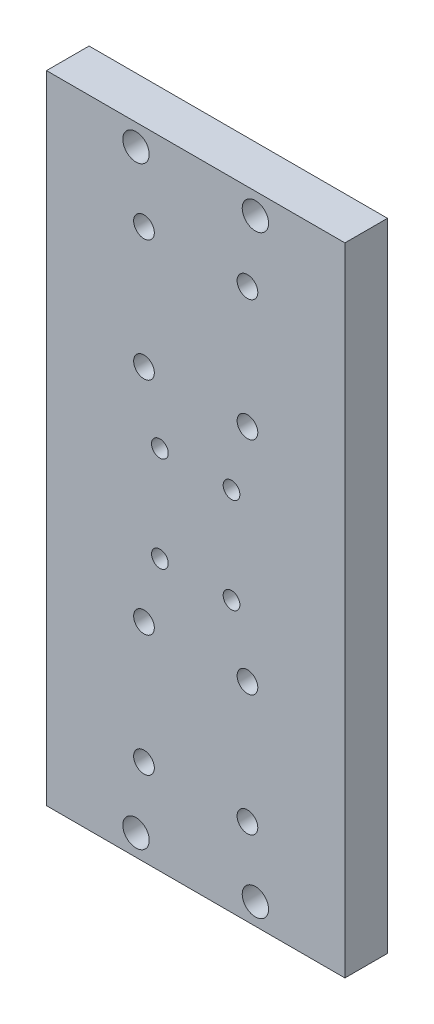
ISO-10303-21;
HEADER;
FILE_DESCRIPTION(('STEP AP214'),'2;1');
FILE_NAME('part.step','',(''),(''),'','','');
FILE_SCHEMA(('AUTOMOTIVE_DESIGN { 1 0 10303 214 1 1 1 1 }'));
ENDSEC;
DATA;
#1=APPLICATION_CONTEXT('core data for automotive mechanical design processes');
#2=APPLICATION_PROTOCOL_DEFINITION('international standard','automotive_design',2000,#1);
#3=PRODUCT_CONTEXT('',#1,'mechanical');
#4=PRODUCT('Part','Part','',(#3));
#5=PRODUCT_RELATED_PRODUCT_CATEGORY('part','',(#4));
#6=PRODUCT_DEFINITION_FORMATION('','',#4);
#7=PRODUCT_DEFINITION_CONTEXT('part definition',#1,'design');
#8=PRODUCT_DEFINITION('design','',#6,#7);
#9=PRODUCT_DEFINITION_SHAPE('','',#8);
#10=(LENGTH_UNIT() NAMED_UNIT(*) SI_UNIT(.MILLI.,.METRE.));
#11=(NAMED_UNIT(*) PLANE_ANGLE_UNIT() SI_UNIT($,.RADIAN.));
#12=(NAMED_UNIT(*) SI_UNIT($,.STERADIAN.) SOLID_ANGLE_UNIT());
#13=UNCERTAINTY_MEASURE_WITH_UNIT(LENGTH_MEASURE(1.E-05),#10,'distance_accuracy_value','');
#14=(GEOMETRIC_REPRESENTATION_CONTEXT(3) GLOBAL_UNCERTAINTY_ASSIGNED_CONTEXT((#13)) GLOBAL_UNIT_ASSIGNED_CONTEXT((#10,
#11,#12)) REPRESENTATION_CONTEXT('',''));
#15=CARTESIAN_POINT('',(0.,0.,0.));
#16=DIRECTION('',(0.,0.,1.));
#17=DIRECTION('',(1.,0.,0.));
#18=AXIS2_PLACEMENT_3D('',#15,#16,#17);
#19=CARTESIAN_POINT('',(9.00000000000001,-12.,0.));
#20=DIRECTION('',(0.,0.,-1.));
#21=DIRECTION('',(-1.,0.,0.));
#22=AXIS2_PLACEMENT_3D('',#19,#20,#21);
#23=CYLINDRICAL_SURFACE('',#22,2.1);
#24=CARTESIAN_POINT('',(9.00000000000001,-12.,10.7));
#25=DIRECTION('',(0.,0.,-1.));
#26=DIRECTION('',(-1.,0.,0.));
#27=AXIS2_PLACEMENT_3D('',#24,#25,#26);
#28=CIRCLE('',#27,2.1);
#29=CARTESIAN_POINT('',(6.90000000000001,-12.,10.7));
#30=VERTEX_POINT('',#29);
#31=EDGE_CURVE('E216',#30,#30,#28,.T.);
#32=ORIENTED_EDGE('',*,*,#31,.F.);
#33=EDGE_LOOP('',(#32));
#34=FACE_BOUND('',#33,.T.);
#35=CARTESIAN_POINT('',(9.00000000000001,-12.,4.));
#36=DIRECTION('',(0.,0.,-1.));
#37=DIRECTION('',(-1.,0.,0.));
#38=AXIS2_PLACEMENT_3D('',#35,#36,#37);
#39=CIRCLE('',#38,2.1);
#40=CARTESIAN_POINT('',(6.90000000000001,-12.,4.));
#41=VERTEX_POINT('',#40);
#42=EDGE_CURVE('E41',#41,#41,#39,.F.);
#43=ORIENTED_EDGE('',*,*,#42,.F.);
#44=EDGE_LOOP('',(#43));
#45=FACE_BOUND('',#44,.T.);
#46=ADVANCED_FACE('F37',(#34,#45),#23,.F.);
#47=CARTESIAN_POINT('',(-9.00000000000001,-12.,0.));
#48=DIRECTION('',(0.,0.,-1.));
#49=DIRECTION('',(-1.,0.,0.));
#50=AXIS2_PLACEMENT_3D('',#47,#48,#49);
#51=CYLINDRICAL_SURFACE('',#50,2.1);
#52=CARTESIAN_POINT('',(-9.00000000000001,-12.,10.7));
#53=DIRECTION('',(0.,0.,-1.));
#54=DIRECTION('',(-1.,0.,0.));
#55=AXIS2_PLACEMENT_3D('',#52,#53,#54);
#56=CIRCLE('',#55,2.1);
#57=CARTESIAN_POINT('',(-11.1,-12.,10.7));
#58=VERTEX_POINT('',#57);
#59=EDGE_CURVE('E121',#58,#58,#56,.T.);
#60=ORIENTED_EDGE('',*,*,#59,.F.);
#61=EDGE_LOOP('',(#60));
#62=FACE_BOUND('',#61,.T.);
#63=CARTESIAN_POINT('',(-9.00000000000001,-12.,4.));
#64=DIRECTION('',(0.,0.,-1.));
#65=DIRECTION('',(-1.,0.,0.));
#66=AXIS2_PLACEMENT_3D('',#63,#64,#65);
#67=CIRCLE('',#66,2.1);
#68=CARTESIAN_POINT('',(-11.1,-12.,4.));
#69=VERTEX_POINT('',#68);
#70=EDGE_CURVE('E154',#69,#69,#67,.F.);
#71=ORIENTED_EDGE('',*,*,#70,.F.);
#72=EDGE_LOOP('',(#71));
#73=FACE_BOUND('',#72,.T.);
#74=ADVANCED_FACE('F281',(#62,#73),#51,.F.);
#75=CARTESIAN_POINT('',(9.00000000000001,12.,0.));
#76=DIRECTION('',(0.,0.,-1.));
#77=DIRECTION('',(-1.,0.,0.));
#78=AXIS2_PLACEMENT_3D('',#75,#76,#77);
#79=CYLINDRICAL_SURFACE('',#78,2.1);
#80=CARTESIAN_POINT('',(9.00000000000001,12.,10.7));
#81=DIRECTION('',(0.,0.,-1.));
#82=DIRECTION('',(-1.,0.,0.));
#83=AXIS2_PLACEMENT_3D('',#80,#81,#82);
#84=CIRCLE('',#83,2.1);
#85=CARTESIAN_POINT('',(6.90000000000001,12.,10.7));
#86=VERTEX_POINT('',#85);
#87=EDGE_CURVE('E118',#86,#86,#84,.T.);
#88=ORIENTED_EDGE('',*,*,#87,.F.);
#89=EDGE_LOOP('',(#88));
#90=FACE_BOUND('',#89,.T.);
#91=CARTESIAN_POINT('',(9.00000000000001,12.,4.));
#92=DIRECTION('',(0.,0.,-1.));
#93=DIRECTION('',(-1.,0.,0.));
#94=AXIS2_PLACEMENT_3D('',#91,#92,#93);
#95=CIRCLE('',#94,2.1);
#96=CARTESIAN_POINT('',(6.90000000000001,12.,4.));
#97=VERTEX_POINT('',#96);
#98=EDGE_CURVE('E151',#97,#97,#95,.F.);
#99=ORIENTED_EDGE('',*,*,#98,.F.);
#100=EDGE_LOOP('',(#99));
#101=FACE_BOUND('',#100,.T.);
#102=ADVANCED_FACE('F288',(#90,#101),#79,.F.);
#103=CARTESIAN_POINT('',(-9.00000000000001,12.,0.));
#104=DIRECTION('',(0.,0.,-1.));
#105=DIRECTION('',(-1.,0.,0.));
#106=AXIS2_PLACEMENT_3D('',#103,#104,#105);
#107=CYLINDRICAL_SURFACE('',#106,2.1);
#108=CARTESIAN_POINT('',(-9.00000000000001,12.,10.7));
#109=DIRECTION('',(0.,0.,-1.));
#110=DIRECTION('',(-1.,0.,0.));
#111=AXIS2_PLACEMENT_3D('',#108,#109,#110);
#112=CIRCLE('',#111,2.1);
#113=CARTESIAN_POINT('',(-11.1,12.,10.7));
#114=VERTEX_POINT('',#113);
#115=EDGE_CURVE('E122',#114,#114,#112,.T.);
#116=ORIENTED_EDGE('',*,*,#115,.F.);
#117=EDGE_LOOP('',(#116));
#118=FACE_BOUND('',#117,.T.);
#119=CARTESIAN_POINT('',(-9.00000000000001,12.,4.));
#120=DIRECTION('',(0.,0.,-1.));
#121=DIRECTION('',(-1.,0.,0.));
#122=AXIS2_PLACEMENT_3D('',#119,#120,#121);
#123=CIRCLE('',#122,2.1);
#124=CARTESIAN_POINT('',(-11.1,12.,4.));
#125=VERTEX_POINT('',#124);
#126=EDGE_CURVE('E148',#125,#125,#123,.F.);
#127=ORIENTED_EDGE('',*,*,#126,.F.);
#128=EDGE_LOOP('',(#127));
#129=FACE_BOUND('',#128,.T.);
#130=ADVANCED_FACE('F323',(#118,#129),#107,.F.);
#131=CARTESIAN_POINT('',(-13.,-58.25,0.));
#132=DIRECTION('',(0.,0.,-1.));
#133=DIRECTION('',(-1.,0.,0.));
#134=AXIS2_PLACEMENT_3D('',#131,#132,#133);
#135=CYLINDRICAL_SURFACE('',#134,2.6);
#136=CARTESIAN_POINT('',(-13.,-58.25,10.7));
#137=DIRECTION('',(0.,0.,-1.));
#138=DIRECTION('',(-1.,0.,0.));
#139=AXIS2_PLACEMENT_3D('',#136,#137,#138);
#140=CIRCLE('',#139,2.6);
#141=CARTESIAN_POINT('',(-15.6,-58.25,10.7));
#142=VERTEX_POINT('',#141);
#143=EDGE_CURVE('E237',#142,#142,#140,.T.);
#144=ORIENTED_EDGE('',*,*,#143,.F.);
#145=EDGE_LOOP('',(#144));
#146=FACE_BOUND('',#145,.T.);
#147=CARTESIAN_POINT('',(-13.,-58.25,5.));
#148=DIRECTION('',(0.,0.,-1.));
#149=DIRECTION('',(-1.,0.,0.));
#150=AXIS2_PLACEMENT_3D('',#147,#148,#149);
#151=CIRCLE('',#150,2.6);
#152=CARTESIAN_POINT('',(-15.6,-58.25,5.));
#153=VERTEX_POINT('',#152);
#154=EDGE_CURVE('E142',#153,#153,#151,.F.);
#155=ORIENTED_EDGE('',*,*,#154,.F.);
#156=EDGE_LOOP('',(#155));
#157=FACE_BOUND('',#156,.T.);
#158=ADVANCED_FACE('F315',(#146,#157),#135,.F.);
#159=CARTESIAN_POINT('',(-13.,-27.75,0.));
#160=DIRECTION('',(0.,0.,-1.));
#161=DIRECTION('',(-1.,0.,0.));
#162=AXIS2_PLACEMENT_3D('',#159,#160,#161);
#163=CYLINDRICAL_SURFACE('',#162,2.6);
#164=CARTESIAN_POINT('',(-13.,-27.75,10.7));
#165=DIRECTION('',(0.,0.,-1.));
#166=DIRECTION('',(-1.,0.,0.));
#167=AXIS2_PLACEMENT_3D('',#164,#165,#166);
#168=CIRCLE('',#167,2.6);
#169=CARTESIAN_POINT('',(-15.6,-27.75,10.7));
#170=VERTEX_POINT('',#169);
#171=EDGE_CURVE('E231',#170,#170,#168,.T.);
#172=ORIENTED_EDGE('',*,*,#171,.F.);
#173=EDGE_LOOP('',(#172));
#174=FACE_BOUND('',#173,.T.);
#175=CARTESIAN_POINT('',(-13.,-27.75,5.));
#176=DIRECTION('',(0.,0.,-1.));
#177=DIRECTION('',(-1.,0.,0.));
#178=AXIS2_PLACEMENT_3D('',#175,#176,#177);
#179=CIRCLE('',#178,2.6);
#180=CARTESIAN_POINT('',(-15.6,-27.75,5.));
#181=VERTEX_POINT('',#180);
#182=EDGE_CURVE('E136',#181,#181,#179,.F.);
#183=ORIENTED_EDGE('',*,*,#182,.F.);
#184=EDGE_LOOP('',(#183));
#185=FACE_BOUND('',#184,.T.);
#186=ADVANCED_FACE('F311',(#174,#185),#163,.F.);
#187=CARTESIAN_POINT('',(13.,58.25,0.));
#188=DIRECTION('',(0.,0.,-1.));
#189=DIRECTION('',(-1.,0.,0.));
#190=AXIS2_PLACEMENT_3D('',#187,#188,#189);
#191=CYLINDRICAL_SURFACE('',#190,2.6);
#192=CARTESIAN_POINT('',(13.,58.25,10.7));
#193=DIRECTION('',(0.,0.,-1.));
#194=DIRECTION('',(-1.,0.,0.));
#195=AXIS2_PLACEMENT_3D('',#192,#193,#194);
#196=CIRCLE('',#195,2.6);
#197=CARTESIAN_POINT('',(10.4,58.25,10.7));
#198=VERTEX_POINT('',#197);
#199=EDGE_CURVE('E228',#198,#198,#196,.T.);
#200=ORIENTED_EDGE('',*,*,#199,.F.);
#201=EDGE_LOOP('',(#200));
#202=FACE_BOUND('',#201,.T.);
#203=CARTESIAN_POINT('',(13.,58.25,5.));
#204=DIRECTION('',(0.,0.,-1.));
#205=DIRECTION('',(-1.,0.,0.));
#206=AXIS2_PLACEMENT_3D('',#203,#204,#205);
#207=CIRCLE('',#206,2.6);
#208=CARTESIAN_POINT('',(10.4,58.25,5.));
#209=VERTEX_POINT('',#208);
#210=EDGE_CURVE('E133',#209,#209,#207,.F.);
#211=ORIENTED_EDGE('',*,*,#210,.F.);
#212=EDGE_LOOP('',(#211));
#213=FACE_BOUND('',#212,.T.);
#214=ADVANCED_FACE('F307',(#202,#213),#191,.F.);
#215=CARTESIAN_POINT('',(13.,27.75,0.));
#216=DIRECTION('',(0.,0.,-1.));
#217=DIRECTION('',(-1.,0.,0.));
#218=AXIS2_PLACEMENT_3D('',#215,#216,#217);
#219=CYLINDRICAL_SURFACE('',#218,2.6);
#220=CARTESIAN_POINT('',(13.,27.75,10.7));
#221=DIRECTION('',(0.,0.,-1.));
#222=DIRECTION('',(-1.,0.,0.));
#223=AXIS2_PLACEMENT_3D('',#220,#221,#222);
#224=CIRCLE('',#223,2.6);
#225=CARTESIAN_POINT('',(10.4,27.75,10.7));
#226=VERTEX_POINT('',#225);
#227=EDGE_CURVE('E225',#226,#226,#224,.T.);
#228=ORIENTED_EDGE('',*,*,#227,.F.);
#229=EDGE_LOOP('',(#228));
#230=FACE_BOUND('',#229,.T.);
#231=CARTESIAN_POINT('',(13.,27.75,5.));
#232=DIRECTION('',(0.,0.,-1.));
#233=DIRECTION('',(-1.,0.,0.));
#234=AXIS2_PLACEMENT_3D('',#231,#232,#233);
#235=CIRCLE('',#234,2.6);
#236=CARTESIAN_POINT('',(10.4,27.75,5.));
#237=VERTEX_POINT('',#236);
#238=EDGE_CURVE('E130',#237,#237,#235,.F.);
#239=ORIENTED_EDGE('',*,*,#238,.F.);
#240=EDGE_LOOP('',(#239));
#241=FACE_BOUND('',#240,.T.);
#242=ADVANCED_FACE('F304',(#230,#241),#219,.F.);
#243=CARTESIAN_POINT('',(-37.5,80.,10.7));
#244=DIRECTION('',(1.,0.,0.));
#245=DIRECTION('',(0.,1.,0.));
#246=AXIS2_PLACEMENT_3D('',#243,#244,#245);
#247=PLANE('',#246);
#248=DIRECTION('',(0.,-1.,0.));
#249=VECTOR('',#248,1.);
#250=CARTESIAN_POINT('',(-37.5,80.,0.));
#251=LINE('',#250,#249);
#252=CARTESIAN_POINT('',(-37.5,80.,0.));
#253=VERTEX_POINT('',#252);
#254=CARTESIAN_POINT('',(-37.5,-80.,0.));
#255=VERTEX_POINT('',#254);
#256=EDGE_CURVE('E104',#253,#255,#251,.T.);
#257=ORIENTED_EDGE('',*,*,#256,.T.);
#258=DIRECTION('',(0.,0.,-1.));
#259=VECTOR('',#258,1.);
#260=CARTESIAN_POINT('',(-37.5,-80.,10.7));
#261=LINE('',#260,#259);
#262=CARTESIAN_POINT('',(-37.5,-80.,10.7));
#263=VERTEX_POINT('',#262);
#264=EDGE_CURVE('E11',#263,#255,#261,.T.);
#265=ORIENTED_EDGE('',*,*,#264,.F.);
#266=DIRECTION('',(0.,-1.,0.));
#267=VECTOR('',#266,1.);
#268=CARTESIAN_POINT('',(-37.5,80.,10.7));
#269=LINE('',#268,#267);
#270=CARTESIAN_POINT('',(-37.5,80.,10.7));
#271=VERTEX_POINT('',#270);
#272=EDGE_CURVE('E91',#271,#263,#269,.T.);
#273=ORIENTED_EDGE('',*,*,#272,.F.);
#274=DIRECTION('',(0.,0.,-1.));
#275=VECTOR('',#274,1.);
#276=CARTESIAN_POINT('',(-37.5,80.,10.7));
#277=LINE('',#276,#275);
#278=EDGE_CURVE('E100',#271,#253,#277,.T.);
#279=ORIENTED_EDGE('',*,*,#278,.T.);
#280=EDGE_LOOP('',(#257,#265,#273,#279));
#281=FACE_BOUND('',#280,.T.);
#282=ADVANCED_FACE('F39',(#281),#247,.F.);
#283=CARTESIAN_POINT('',(37.5,-80.,10.7));
#284=DIRECTION('',(0.,1.,0.));
#285=DIRECTION('',(0.,0.,1.));
#286=AXIS2_PLACEMENT_3D('',#283,#284,#285);
#287=PLANE('',#286);
#288=DIRECTION('',(1.,0.,0.));
#289=VECTOR('',#288,1.);
#290=CARTESIAN_POINT('',(37.5,-80.,0.));
#291=LINE('',#290,#289);
#292=CARTESIAN_POINT('',(37.5,-80.,0.));
#293=VERTEX_POINT('',#292);
#294=EDGE_CURVE('E95',#255,#293,#291,.T.);
#295=ORIENTED_EDGE('',*,*,#294,.T.);
#296=DIRECTION('',(0.,0.,-1.));
#297=VECTOR('',#296,1.);
#298=CARTESIAN_POINT('',(37.5,-80.,10.7));
#299=LINE('',#298,#297);
#300=CARTESIAN_POINT('',(37.5,-80.,10.7));
#301=VERTEX_POINT('',#300);
#302=EDGE_CURVE('E47',#301,#293,#299,.T.);
#303=ORIENTED_EDGE('',*,*,#302,.F.);
#304=DIRECTION('',(1.,0.,0.));
#305=VECTOR('',#304,1.);
#306=CARTESIAN_POINT('',(37.5,-80.,10.7));
#307=LINE('',#306,#305);
#308=EDGE_CURVE('E86',#263,#301,#307,.T.);
#309=ORIENTED_EDGE('',*,*,#308,.F.);
#310=ORIENTED_EDGE('',*,*,#264,.T.);
#311=EDGE_LOOP('',(#295,#303,#309,#310));
#312=FACE_BOUND('',#311,.T.);
#313=ADVANCED_FACE('F94',(#312),#287,.F.);
#314=CARTESIAN_POINT('',(37.5,80.,10.7));
#315=DIRECTION('',(-1.,0.,0.));
#316=DIRECTION('',(0.,-1.,0.));
#317=AXIS2_PLACEMENT_3D('',#314,#315,#316);
#318=PLANE('',#317);
#319=DIRECTION('',(0.,1.,0.));
#320=VECTOR('',#319,1.);
#321=CARTESIAN_POINT('',(37.5,80.,0.));
#322=LINE('',#321,#320);
#323=CARTESIAN_POINT('',(37.5,80.,0.));
#324=VERTEX_POINT('',#323);
#325=EDGE_CURVE('E73',#293,#324,#322,.T.);
#326=ORIENTED_EDGE('',*,*,#325,.T.);
#327=DIRECTION('',(0.,0.,-1.));
#328=VECTOR('',#327,1.);
#329=CARTESIAN_POINT('',(37.5,80.,10.7));
#330=LINE('',#329,#328);
#331=CARTESIAN_POINT('',(37.5,80.,10.7));
#332=VERTEX_POINT('',#331);
#333=EDGE_CURVE('E96',#332,#324,#330,.T.);
#334=ORIENTED_EDGE('',*,*,#333,.F.);
#335=DIRECTION('',(0.,1.,0.));
#336=VECTOR('',#335,1.);
#337=CARTESIAN_POINT('',(37.5,80.,10.7));
#338=LINE('',#337,#336);
#339=EDGE_CURVE('E89',#301,#332,#338,.T.);
#340=ORIENTED_EDGE('',*,*,#339,.F.);
#341=ORIENTED_EDGE('',*,*,#302,.T.);
#342=EDGE_LOOP('',(#326,#334,#340,#341));
#343=FACE_BOUND('',#342,.T.);
#344=ADVANCED_FACE('F98',(#343),#318,.F.);
#345=CARTESIAN_POINT('',(37.5,80.,10.7));
#346=DIRECTION('',(0.,-1.,0.));
#347=DIRECTION('',(0.,0.,-1.));
#348=AXIS2_PLACEMENT_3D('',#345,#346,#347);
#349=PLANE('',#348);
#350=DIRECTION('',(-1.,0.,0.));
#351=VECTOR('',#350,1.);
#352=CARTESIAN_POINT('',(37.5,80.,0.));
#353=LINE('',#352,#351);
#354=EDGE_CURVE('E79',#324,#253,#353,.T.);
#355=ORIENTED_EDGE('',*,*,#354,.T.);
#356=ORIENTED_EDGE('',*,*,#278,.F.);
#357=DIRECTION('',(-1.,0.,0.));
#358=VECTOR('',#357,1.);
#359=CARTESIAN_POINT('',(37.5,80.,10.7));
#360=LINE('',#359,#358);
#361=EDGE_CURVE('E56',#332,#271,#360,.T.);
#362=ORIENTED_EDGE('',*,*,#361,.F.);
#363=ORIENTED_EDGE('',*,*,#333,.T.);
#364=EDGE_LOOP('',(#355,#356,#362,#363));
#365=FACE_BOUND('',#364,.T.);
#366=ADVANCED_FACE('F342',(#365),#349,.F.);
#367=CARTESIAN_POINT('',(0.,0.,10.7));
#368=DIRECTION('',(0.,0.,-1.));
#369=DIRECTION('',(-1.,0.,0.));
#370=AXIS2_PLACEMENT_3D('',#367,#368,#369);
#371=PLANE('',#370);
#372=ORIENTED_EDGE('',*,*,#115,.T.);
#373=EDGE_LOOP('',(#372));
#374=FACE_BOUND('',#373,.T.);
#375=ORIENTED_EDGE('',*,*,#87,.T.);
#376=EDGE_LOOP('',(#375));
#377=FACE_BOUND('',#376,.T.);
#378=ORIENTED_EDGE('',*,*,#59,.T.);
#379=EDGE_LOOP('',(#378));
#380=FACE_BOUND('',#379,.T.);
#381=ORIENTED_EDGE('',*,*,#31,.T.);
#382=EDGE_LOOP('',(#381));
#383=FACE_BOUND('',#382,.T.);
#384=CARTESIAN_POINT('',(-13.,58.25,10.7));
#385=DIRECTION('',(0.,0.,-1.));
#386=DIRECTION('',(-1.,0.,0.));
#387=AXIS2_PLACEMENT_3D('',#384,#385,#386);
#388=CIRCLE('',#387,2.6);
#389=CARTESIAN_POINT('',(-15.6,58.25,10.7));
#390=VERTEX_POINT('',#389);
#391=EDGE_CURVE('E219',#390,#390,#388,.T.);
#392=ORIENTED_EDGE('',*,*,#391,.T.);
#393=EDGE_LOOP('',(#392));
#394=FACE_BOUND('',#393,.T.);
#395=CARTESIAN_POINT('',(-13.,27.75,10.7));
#396=DIRECTION('',(0.,0.,-1.));
#397=DIRECTION('',(-1.,0.,0.));
#398=AXIS2_PLACEMENT_3D('',#395,#396,#397);
#399=CIRCLE('',#398,2.6);
#400=CARTESIAN_POINT('',(-15.6,27.75,10.7));
#401=VERTEX_POINT('',#400);
#402=EDGE_CURVE('E222',#401,#401,#399,.T.);
#403=ORIENTED_EDGE('',*,*,#402,.T.);
#404=EDGE_LOOP('',(#403));
#405=FACE_BOUND('',#404,.T.);
#406=ORIENTED_EDGE('',*,*,#227,.T.);
#407=EDGE_LOOP('',(#406));
#408=FACE_BOUND('',#407,.T.);
#409=ORIENTED_EDGE('',*,*,#199,.T.);
#410=EDGE_LOOP('',(#409));
#411=FACE_BOUND('',#410,.T.);
#412=ORIENTED_EDGE('',*,*,#171,.T.);
#413=EDGE_LOOP('',(#412));
#414=FACE_BOUND('',#413,.T.);
#415=CARTESIAN_POINT('',(13.,-27.75,10.7));
#416=DIRECTION('',(0.,0.,-1.));
#417=DIRECTION('',(-1.,0.,0.));
#418=AXIS2_PLACEMENT_3D('',#415,#416,#417);
#419=CIRCLE('',#418,2.6);
#420=CARTESIAN_POINT('',(10.4,-27.75,10.7));
#421=VERTEX_POINT('',#420);
#422=EDGE_CURVE('E234',#421,#421,#419,.T.);
#423=ORIENTED_EDGE('',*,*,#422,.T.);
#424=EDGE_LOOP('',(#423));
#425=FACE_BOUND('',#424,.T.);
#426=ORIENTED_EDGE('',*,*,#143,.T.);
#427=EDGE_LOOP('',(#426));
#428=FACE_BOUND('',#427,.T.);
#429=CARTESIAN_POINT('',(13.,-58.25,10.7));
#430=DIRECTION('',(0.,0.,-1.));
#431=DIRECTION('',(-1.,0.,0.));
#432=AXIS2_PLACEMENT_3D('',#429,#430,#431);
#433=CIRCLE('',#432,2.6);
#434=CARTESIAN_POINT('',(10.4,-58.25,10.7));
#435=VERTEX_POINT('',#434);
#436=EDGE_CURVE('E240',#435,#435,#433,.T.);
#437=ORIENTED_EDGE('',*,*,#436,.T.);
#438=EDGE_LOOP('',(#437));
#439=FACE_BOUND('',#438,.T.);
#440=CARTESIAN_POINT('',(-15.,74.65,10.7));
#441=DIRECTION('',(0.,0.,-1.));
#442=DIRECTION('',(-1.,0.,0.));
#443=AXIS2_PLACEMENT_3D('',#440,#441,#442);
#444=CIRCLE('',#443,3.31469999999999);
#445=CARTESIAN_POINT('',(-18.3147,74.65,10.7));
#446=VERTEX_POINT('',#445);
#447=EDGE_CURVE('E113',#446,#446,#444,.T.);
#448=ORIENTED_EDGE('',*,*,#447,.T.);
#449=EDGE_LOOP('',(#448));
#450=FACE_BOUND('',#449,.T.);
#451=CARTESIAN_POINT('',(15.,74.65,10.7));
#452=DIRECTION('',(0.,0.,-1.));
#453=DIRECTION('',(-1.,0.,0.));
#454=AXIS2_PLACEMENT_3D('',#451,#452,#453);
#455=CIRCLE('',#454,3.31469999999999);
#456=CARTESIAN_POINT('',(11.6853,74.65,10.7));
#457=VERTEX_POINT('',#456);
#458=EDGE_CURVE('E247',#457,#457,#455,.T.);
#459=ORIENTED_EDGE('',*,*,#458,.T.);
#460=EDGE_LOOP('',(#459));
#461=FACE_BOUND('',#460,.T.);
#462=CARTESIAN_POINT('',(-15.,-74.65,10.7));
#463=DIRECTION('',(0.,0.,-1.));
#464=DIRECTION('',(-1.,0.,0.));
#465=AXIS2_PLACEMENT_3D('',#462,#463,#464);
#466=CIRCLE('',#465,3.31469999999999);
#467=CARTESIAN_POINT('',(-18.3147,-74.65,10.7));
#468=VERTEX_POINT('',#467);
#469=EDGE_CURVE('E253',#468,#468,#466,.T.);
#470=ORIENTED_EDGE('',*,*,#469,.T.);
#471=EDGE_LOOP('',(#470));
#472=FACE_BOUND('',#471,.T.);
#473=CARTESIAN_POINT('',(15.,-74.65,10.7));
#474=DIRECTION('',(0.,0.,-1.));
#475=DIRECTION('',(-1.,0.,0.));
#476=AXIS2_PLACEMENT_3D('',#473,#474,#475);
#477=CIRCLE('',#476,3.31469999999999);
#478=CARTESIAN_POINT('',(11.6853,-74.65,10.7));
#479=VERTEX_POINT('',#478);
#480=EDGE_CURVE('E107',#479,#479,#477,.T.);
#481=ORIENTED_EDGE('',*,*,#480,.T.);
#482=EDGE_LOOP('',(#481));
#483=FACE_BOUND('',#482,.T.);
#484=ORIENTED_EDGE('',*,*,#272,.T.);
#485=ORIENTED_EDGE('',*,*,#308,.T.);
#486=ORIENTED_EDGE('',*,*,#339,.T.);
#487=ORIENTED_EDGE('',*,*,#361,.T.);
#488=EDGE_LOOP('',(#484,#485,#486,#487));
#489=FACE_BOUND('',#488,.T.);
#490=ADVANCED_FACE('F87',(#374,#377,#380,#383,#394,#405,#408,#411,#414,#425,#428,#439,#450,#461,
#472,#483,#489),#371,.F.);
#491=CARTESIAN_POINT('',(0.,0.,0.));
#492=DIRECTION('',(0.,0.,-1.));
#493=DIRECTION('',(-1.,0.,0.));
#494=AXIS2_PLACEMENT_3D('',#491,#492,#493);
#495=PLANE('',#494);
#496=CARTESIAN_POINT('',(-9.00000000000001,12.,0.));
#497=DIRECTION('',(0.,0.,-1.));
#498=DIRECTION('',(-1.,0.,0.));
#499=AXIS2_PLACEMENT_3D('',#496,#497,#498);
#500=CIRCLE('',#499,3.5);
#501=CARTESIAN_POINT('',(-12.5,12.,0.));
#502=VERTEX_POINT('',#501);
#503=EDGE_CURVE('E794',#502,#502,#500,.T.);
#504=ORIENTED_EDGE('',*,*,#503,.F.);
#505=EDGE_LOOP('',(#504));
#506=FACE_BOUND('',#505,.T.);
#507=CARTESIAN_POINT('',(9.00000000000001,-12.,0.));
#508=DIRECTION('',(0.,0.,-1.));
#509=DIRECTION('',(-1.,0.,0.));
#510=AXIS2_PLACEMENT_3D('',#507,#508,#509);
#511=CIRCLE('',#510,3.5);
#512=CARTESIAN_POINT('',(5.50000000000001,-12.,0.));
#513=VERTEX_POINT('',#512);
#514=EDGE_CURVE('E790',#513,#513,#511,.T.);
#515=ORIENTED_EDGE('',*,*,#514,.F.);
#516=EDGE_LOOP('',(#515));
#517=FACE_BOUND('',#516,.T.);
#518=CARTESIAN_POINT('',(-9.00000000000001,-12.,0.));
#519=DIRECTION('',(0.,0.,-1.));
#520=DIRECTION('',(-1.,0.,0.));
#521=AXIS2_PLACEMENT_3D('',#518,#519,#520);
#522=CIRCLE('',#521,3.5);
#523=CARTESIAN_POINT('',(-12.5,-12.,0.));
#524=VERTEX_POINT('',#523);
#525=EDGE_CURVE('E797',#524,#524,#522,.T.);
#526=ORIENTED_EDGE('',*,*,#525,.F.);
#527=EDGE_LOOP('',(#526));
#528=FACE_BOUND('',#527,.T.);
#529=CARTESIAN_POINT('',(9.00000000000001,12.,0.));
#530=DIRECTION('',(0.,0.,-1.));
#531=DIRECTION('',(-1.,0.,0.));
#532=AXIS2_PLACEMENT_3D('',#529,#530,#531);
#533=CIRCLE('',#532,3.5);
#534=CARTESIAN_POINT('',(5.50000000000001,12.,0.));
#535=VERTEX_POINT('',#534);
#536=EDGE_CURVE('E802',#535,#535,#533,.T.);
#537=ORIENTED_EDGE('',*,*,#536,.F.);
#538=EDGE_LOOP('',(#537));
#539=FACE_BOUND('',#538,.T.);
#540=CARTESIAN_POINT('',(-13.,-27.75,0.));
#541=DIRECTION('',(0.,0.,-1.));
#542=DIRECTION('',(-1.,0.,0.));
#543=AXIS2_PLACEMENT_3D('',#540,#541,#542);
#544=CIRCLE('',#543,4.25);
#545=CARTESIAN_POINT('',(-17.25,-27.75,0.));
#546=VERTEX_POINT('',#545);
#547=EDGE_CURVE('E175',#546,#546,#544,.T.);
#548=ORIENTED_EDGE('',*,*,#547,.F.);
#549=EDGE_LOOP('',(#548));
#550=FACE_BOUND('',#549,.T.);
#551=CARTESIAN_POINT('',(-13.,58.25,0.));
#552=DIRECTION('',(0.,0.,-1.));
#553=DIRECTION('',(1.,0.,0.));
#554=AXIS2_PLACEMENT_3D('',#551,#552,#553);
#555=CIRCLE('',#554,4.25);
#556=CARTESIAN_POINT('',(-8.75,58.25,0.));
#557=VERTEX_POINT('',#556);
#558=EDGE_CURVE('E188',#557,#557,#555,.T.);
#559=ORIENTED_EDGE('',*,*,#558,.F.);
#560=EDGE_LOOP('',(#559));
#561=FACE_BOUND('',#560,.T.);
#562=CARTESIAN_POINT('',(-13.,27.75,0.));
#563=DIRECTION('',(0.,0.,-1.));
#564=DIRECTION('',(1.,0.,0.));
#565=AXIS2_PLACEMENT_3D('',#562,#563,#564);
#566=CIRCLE('',#565,4.25);
#567=CARTESIAN_POINT('',(-8.75000000000001,27.75,0.));
#568=VERTEX_POINT('',#567);
#569=EDGE_CURVE('E187',#568,#568,#566,.T.);
#570=ORIENTED_EDGE('',*,*,#569,.F.);
#571=EDGE_LOOP('',(#570));
#572=FACE_BOUND('',#571,.T.);
#573=CARTESIAN_POINT('',(13.,27.75,0.));
#574=DIRECTION('',(0.,0.,-1.));
#575=DIRECTION('',(-1.,0.,0.));
#576=AXIS2_PLACEMENT_3D('',#573,#574,#575);
#577=CIRCLE('',#576,4.25);
#578=CARTESIAN_POINT('',(8.75000000000001,27.75,0.));
#579=VERTEX_POINT('',#578);
#580=EDGE_CURVE('E200',#579,#579,#577,.T.);
#581=ORIENTED_EDGE('',*,*,#580,.F.);
#582=EDGE_LOOP('',(#581));
#583=FACE_BOUND('',#582,.T.);
#584=CARTESIAN_POINT('',(13.,-58.25,0.));
#585=DIRECTION('',(0.,0.,-1.));
#586=DIRECTION('',(1.,0.,0.));
#587=AXIS2_PLACEMENT_3D('',#584,#585,#586);
#588=CIRCLE('',#587,4.25);
#589=CARTESIAN_POINT('',(17.25,-58.25,0.));
#590=VERTEX_POINT('',#589);
#591=EDGE_CURVE('E159',#590,#590,#588,.T.);
#592=ORIENTED_EDGE('',*,*,#591,.F.);
#593=EDGE_LOOP('',(#592));
#594=FACE_BOUND('',#593,.T.);
#595=CARTESIAN_POINT('',(-13.,-58.25,0.));
#596=DIRECTION('',(0.,0.,-1.));
#597=DIRECTION('',(-1.,0.,0.));
#598=AXIS2_PLACEMENT_3D('',#595,#596,#597);
#599=CIRCLE('',#598,4.25);
#600=CARTESIAN_POINT('',(-17.25,-58.25,0.));
#601=VERTEX_POINT('',#600);
#602=EDGE_CURVE('E168',#601,#601,#599,.T.);
#603=ORIENTED_EDGE('',*,*,#602,.F.);
#604=EDGE_LOOP('',(#603));
#605=FACE_BOUND('',#604,.T.);
#606=CARTESIAN_POINT('',(13.,-27.75,0.));
#607=DIRECTION('',(0.,0.,-1.));
#608=DIRECTION('',(1.,0.,0.));
#609=AXIS2_PLACEMENT_3D('',#606,#607,#608);
#610=CIRCLE('',#609,4.25);
#611=CARTESIAN_POINT('',(17.25,-27.75,0.));
#612=VERTEX_POINT('',#611);
#613=EDGE_CURVE('E176',#612,#612,#610,.T.);
#614=ORIENTED_EDGE('',*,*,#613,.F.);
#615=EDGE_LOOP('',(#614));
#616=FACE_BOUND('',#615,.T.);
#617=CARTESIAN_POINT('',(13.,58.25,0.));
#618=DIRECTION('',(0.,0.,-1.));
#619=DIRECTION('',(-1.,0.,0.));
#620=AXIS2_PLACEMENT_3D('',#617,#618,#619);
#621=CIRCLE('',#620,4.25);
#622=CARTESIAN_POINT('',(8.75,58.25,0.));
#623=VERTEX_POINT('',#622);
#624=EDGE_CURVE('E199',#623,#623,#621,.T.);
#625=ORIENTED_EDGE('',*,*,#624,.F.);
#626=EDGE_LOOP('',(#625));
#627=FACE_BOUND('',#626,.T.);
#628=CARTESIAN_POINT('',(-15.,74.65,0.));
#629=DIRECTION('',(0.,0.,-1.));
#630=DIRECTION('',(-1.,0.,0.));
#631=AXIS2_PLACEMENT_3D('',#628,#629,#630);
#632=CIRCLE('',#631,3.31469999999999);
#633=CARTESIAN_POINT('',(-18.3147,74.65,0.));
#634=VERTEX_POINT('',#633);
#635=EDGE_CURVE('E117',#634,#634,#632,.T.);
#636=ORIENTED_EDGE('',*,*,#635,.F.);
#637=EDGE_LOOP('',(#636));
#638=FACE_BOUND('',#637,.T.);
#639=CARTESIAN_POINT('',(15.,74.65,0.));
#640=DIRECTION('',(0.,0.,-1.));
#641=DIRECTION('',(-1.,0.,0.));
#642=AXIS2_PLACEMENT_3D('',#639,#640,#641);
#643=CIRCLE('',#642,3.31469999999999);
#644=CARTESIAN_POINT('',(11.6853,74.65,0.));
#645=VERTEX_POINT('',#644);
#646=EDGE_CURVE('E116',#645,#645,#643,.T.);
#647=ORIENTED_EDGE('',*,*,#646,.F.);
#648=EDGE_LOOP('',(#647));
#649=FACE_BOUND('',#648,.T.);
#650=CARTESIAN_POINT('',(-15.,-74.65,0.));
#651=DIRECTION('',(0.,0.,-1.));
#652=DIRECTION('',(-1.,0.,0.));
#653=AXIS2_PLACEMENT_3D('',#650,#651,#652);
#654=CIRCLE('',#653,3.31469999999999);
#655=CARTESIAN_POINT('',(-18.3147,-74.65,0.));
#656=VERTEX_POINT('',#655);
#657=EDGE_CURVE('E250',#656,#656,#654,.T.);
#658=ORIENTED_EDGE('',*,*,#657,.F.);
#659=EDGE_LOOP('',(#658));
#660=FACE_BOUND('',#659,.T.);
#661=CARTESIAN_POINT('',(15.,-74.65,0.));
#662=DIRECTION('',(0.,0.,-1.));
#663=DIRECTION('',(-1.,0.,0.));
#664=AXIS2_PLACEMENT_3D('',#661,#662,#663);
#665=CIRCLE('',#664,3.31469999999999);
#666=CARTESIAN_POINT('',(11.6853,-74.65,0.));
#667=VERTEX_POINT('',#666);
#668=EDGE_CURVE('E256',#667,#667,#665,.T.);
#669=ORIENTED_EDGE('',*,*,#668,.F.);
#670=EDGE_LOOP('',(#669));
#671=FACE_BOUND('',#670,.T.);
#672=ORIENTED_EDGE('',*,*,#256,.F.);
#673=ORIENTED_EDGE('',*,*,#354,.F.);
#674=ORIENTED_EDGE('',*,*,#325,.F.);
#675=ORIENTED_EDGE('',*,*,#294,.F.);
#676=EDGE_LOOP('',(#672,#673,#674,#675));
#677=FACE_BOUND('',#676,.T.);
#678=ADVANCED_FACE('F266',(#506,#517,#528,#539,#550,#561,#572,#583,#594,#605,#616,#627,#638,
#649,#660,#671,#677),#495,.T.);
#679=CARTESIAN_POINT('',(15.,-74.65,0.));
#680=DIRECTION('',(0.,0.,-1.));
#681=DIRECTION('',(-1.,0.,0.));
#682=AXIS2_PLACEMENT_3D('',#679,#680,#681);
#683=CYLINDRICAL_SURFACE('',#682,3.31469999999999);
#684=ORIENTED_EDGE('',*,*,#668,.T.);
#685=EDGE_LOOP('',(#684));
#686=FACE_BOUND('',#685,.T.);
#687=ORIENTED_EDGE('',*,*,#480,.F.);
#688=EDGE_LOOP('',(#687));
#689=FACE_BOUND('',#688,.T.);
#690=ADVANCED_FACE('F263',(#686,#689),#683,.F.);
#691=CARTESIAN_POINT('',(-15.,-74.65,0.));
#692=DIRECTION('',(0.,0.,-1.));
#693=DIRECTION('',(-1.,0.,0.));
#694=AXIS2_PLACEMENT_3D('',#691,#692,#693);
#695=CYLINDRICAL_SURFACE('',#694,3.31469999999999);
#696=ORIENTED_EDGE('',*,*,#657,.T.);
#697=EDGE_LOOP('',(#696));
#698=FACE_BOUND('',#697,.T.);
#699=ORIENTED_EDGE('',*,*,#469,.F.);
#700=EDGE_LOOP('',(#699));
#701=FACE_BOUND('',#700,.T.);
#702=ADVANCED_FACE('F265',(#698,#701),#695,.F.);
#703=CARTESIAN_POINT('',(15.,74.65,0.));
#704=DIRECTION('',(0.,0.,-1.));
#705=DIRECTION('',(-1.,0.,0.));
#706=AXIS2_PLACEMENT_3D('',#703,#704,#705);
#707=CYLINDRICAL_SURFACE('',#706,3.31469999999999);
#708=ORIENTED_EDGE('',*,*,#646,.T.);
#709=EDGE_LOOP('',(#708));
#710=FACE_BOUND('',#709,.T.);
#711=ORIENTED_EDGE('',*,*,#458,.F.);
#712=EDGE_LOOP('',(#711));
#713=FACE_BOUND('',#712,.T.);
#714=ADVANCED_FACE('F273',(#710,#713),#707,.F.);
#715=CARTESIAN_POINT('',(-15.,74.65,0.));
#716=DIRECTION('',(0.,0.,-1.));
#717=DIRECTION('',(-1.,0.,0.));
#718=AXIS2_PLACEMENT_3D('',#715,#716,#717);
#719=CYLINDRICAL_SURFACE('',#718,3.31469999999999);
#720=ORIENTED_EDGE('',*,*,#635,.T.);
#721=EDGE_LOOP('',(#720));
#722=FACE_BOUND('',#721,.T.);
#723=ORIENTED_EDGE('',*,*,#447,.F.);
#724=EDGE_LOOP('',(#723));
#725=FACE_BOUND('',#724,.T.);
#726=ADVANCED_FACE('F327',(#722,#725),#719,.F.);
#727=CARTESIAN_POINT('',(13.,-58.25,0.));
#728=DIRECTION('',(0.,0.,-1.));
#729=DIRECTION('',(-1.,0.,0.));
#730=AXIS2_PLACEMENT_3D('',#727,#728,#729);
#731=CYLINDRICAL_SURFACE('',#730,2.6);
#732=CARTESIAN_POINT('',(13.,-58.25,5.));
#733=DIRECTION('',(0.,0.,1.));
#734=DIRECTION('',(1.,0.,0.));
#735=AXIS2_PLACEMENT_3D('',#732,#733,#734);
#736=CIRCLE('',#735,2.6);
#737=CARTESIAN_POINT('',(15.6,-58.25,5.));
#738=VERTEX_POINT('',#737);
#739=EDGE_CURVE('E145',#738,#738,#736,.F.);
#740=ORIENTED_EDGE('',*,*,#739,.T.);
#741=EDGE_LOOP('',(#740));
#742=FACE_BOUND('',#741,.T.);
#743=ORIENTED_EDGE('',*,*,#436,.F.);
#744=EDGE_LOOP('',(#743));
#745=FACE_BOUND('',#744,.T.);
#746=ADVANCED_FACE('F319',(#742,#745),#731,.F.);
#747=CARTESIAN_POINT('',(13.,-27.75,0.));
#748=DIRECTION('',(0.,0.,-1.));
#749=DIRECTION('',(-1.,0.,0.));
#750=AXIS2_PLACEMENT_3D('',#747,#748,#749);
#751=CYLINDRICAL_SURFACE('',#750,2.6);
#752=CARTESIAN_POINT('',(13.,-27.75,5.));
#753=DIRECTION('',(0.,0.,1.));
#754=DIRECTION('',(1.,0.,0.));
#755=AXIS2_PLACEMENT_3D('',#752,#753,#754);
#756=CIRCLE('',#755,2.6);
#757=CARTESIAN_POINT('',(15.6,-27.75,5.));
#758=VERTEX_POINT('',#757);
#759=EDGE_CURVE('E139',#758,#758,#756,.F.);
#760=ORIENTED_EDGE('',*,*,#759,.T.);
#761=EDGE_LOOP('',(#760));
#762=FACE_BOUND('',#761,.T.);
#763=ORIENTED_EDGE('',*,*,#422,.F.);
#764=EDGE_LOOP('',(#763));
#765=FACE_BOUND('',#764,.T.);
#766=ADVANCED_FACE('F302',(#762,#765),#751,.F.);
#767=CARTESIAN_POINT('',(-13.,27.75,0.));
#768=DIRECTION('',(0.,0.,-1.));
#769=DIRECTION('',(-1.,0.,0.));
#770=AXIS2_PLACEMENT_3D('',#767,#768,#769);
#771=CYLINDRICAL_SURFACE('',#770,2.6);
#772=CARTESIAN_POINT('',(-13.,27.75,5.));
#773=DIRECTION('',(0.,0.,1.));
#774=DIRECTION('',(1.,0.,0.));
#775=AXIS2_PLACEMENT_3D('',#772,#773,#774);
#776=CIRCLE('',#775,2.6);
#777=CARTESIAN_POINT('',(-10.4,27.75,5.));
#778=VERTEX_POINT('',#777);
#779=EDGE_CURVE('E126',#778,#778,#776,.F.);
#780=ORIENTED_EDGE('',*,*,#779,.T.);
#781=EDGE_LOOP('',(#780));
#782=FACE_BOUND('',#781,.T.);
#783=ORIENTED_EDGE('',*,*,#402,.F.);
#784=EDGE_LOOP('',(#783));
#785=FACE_BOUND('',#784,.T.);
#786=ADVANCED_FACE('F298',(#782,#785),#771,.F.);
#787=CARTESIAN_POINT('',(-13.,58.25,0.));
#788=DIRECTION('',(0.,0.,-1.));
#789=DIRECTION('',(-1.,0.,0.));
#790=AXIS2_PLACEMENT_3D('',#787,#788,#789);
#791=CYLINDRICAL_SURFACE('',#790,2.6);
#792=CARTESIAN_POINT('',(-13.,58.25,5.));
#793=DIRECTION('',(0.,0.,1.));
#794=DIRECTION('',(1.,0.,0.));
#795=AXIS2_PLACEMENT_3D('',#792,#793,#794);
#796=CIRCLE('',#795,2.6);
#797=CARTESIAN_POINT('',(-10.4,58.25,5.));
#798=VERTEX_POINT('',#797);
#799=EDGE_CURVE('E123',#798,#798,#796,.F.);
#800=ORIENTED_EDGE('',*,*,#799,.T.);
#801=EDGE_LOOP('',(#800));
#802=FACE_BOUND('',#801,.T.);
#803=ORIENTED_EDGE('',*,*,#391,.F.);
#804=EDGE_LOOP('',(#803));
#805=FACE_BOUND('',#804,.T.);
#806=ADVANCED_FACE('F295',(#802,#805),#791,.F.);
#807=CARTESIAN_POINT('',(-13.,58.25,5.));
#808=DIRECTION('',(0.,0.,1.));
#809=DIRECTION('',(1.,0.,0.));
#810=AXIS2_PLACEMENT_3D('',#807,#808,#809);
#811=PLANE('',#810);
#812=CARTESIAN_POINT('',(-13.,58.25,5.));
#813=DIRECTION('',(0.,0.,-1.));
#814=DIRECTION('',(1.,0.,0.));
#815=AXIS2_PLACEMENT_3D('',#812,#813,#814);
#816=CIRCLE('',#815,4.25);
#817=CARTESIAN_POINT('',(-8.75,58.25,5.));
#818=VERTEX_POINT('',#817);
#819=EDGE_CURVE('E184',#818,#818,#816,.T.);
#820=ORIENTED_EDGE('',*,*,#819,.T.);
#821=EDGE_LOOP('',(#820));
#822=FACE_BOUND('',#821,.T.);
#823=ORIENTED_EDGE('',*,*,#799,.F.);
#824=EDGE_LOOP('',(#823));
#825=FACE_BOUND('',#824,.T.);
#826=ADVANCED_FACE('F297',(#822,#825),#811,.F.);
#827=CARTESIAN_POINT('',(-13.,58.25,5.));
#828=DIRECTION('',(0.,0.,-1.));
#829=DIRECTION('',(-1.,0.,0.));
#830=AXIS2_PLACEMENT_3D('',#827,#828,#829);
#831=CYLINDRICAL_SURFACE('',#830,4.25);
#832=ORIENTED_EDGE('',*,*,#819,.F.);
#833=EDGE_LOOP('',(#832));
#834=FACE_BOUND('',#833,.T.);
#835=ORIENTED_EDGE('',*,*,#558,.T.);
#836=EDGE_LOOP('',(#835));
#837=FACE_BOUND('',#836,.T.);
#838=ADVANCED_FACE('F495',(#834,#837),#831,.F.);
#839=CARTESIAN_POINT('',(-13.,27.75,5.));
#840=DIRECTION('',(0.,0.,1.));
#841=DIRECTION('',(1.,0.,0.));
#842=AXIS2_PLACEMENT_3D('',#839,#840,#841);
#843=PLANE('',#842);
#844=CARTESIAN_POINT('',(-13.,27.75,5.));
#845=DIRECTION('',(0.,0.,-1.));
#846=DIRECTION('',(1.,0.,0.));
#847=AXIS2_PLACEMENT_3D('',#844,#845,#846);
#848=CIRCLE('',#847,4.25);
#849=CARTESIAN_POINT('',(-8.75000000000001,27.75,5.));
#850=VERTEX_POINT('',#849);
#851=EDGE_CURVE('E203',#850,#850,#848,.T.);
#852=ORIENTED_EDGE('',*,*,#851,.T.);
#853=EDGE_LOOP('',(#852));
#854=FACE_BOUND('',#853,.T.);
#855=ORIENTED_EDGE('',*,*,#779,.F.);
#856=EDGE_LOOP('',(#855));
#857=FACE_BOUND('',#856,.T.);
#858=ADVANCED_FACE('F506',(#854,#857),#843,.F.);
#859=CARTESIAN_POINT('',(-13.,27.75,5.));
#860=DIRECTION('',(0.,0.,-1.));
#861=DIRECTION('',(-1.,0.,0.));
#862=AXIS2_PLACEMENT_3D('',#859,#860,#861);
#863=CYLINDRICAL_SURFACE('',#862,4.25);
#864=ORIENTED_EDGE('',*,*,#851,.F.);
#865=EDGE_LOOP('',(#864));
#866=FACE_BOUND('',#865,.T.);
#867=ORIENTED_EDGE('',*,*,#569,.T.);
#868=EDGE_LOOP('',(#867));
#869=FACE_BOUND('',#868,.T.);
#870=ADVANCED_FACE('F517',(#866,#869),#863,.F.);
#871=CARTESIAN_POINT('',(13.,27.75,5.));
#872=DIRECTION('',(0.,0.,-1.));
#873=DIRECTION('',(-1.,0.,0.));
#874=AXIS2_PLACEMENT_3D('',#871,#872,#873);
#875=PLANE('',#874);
#876=CARTESIAN_POINT('',(13.,27.75,5.));
#877=DIRECTION('',(0.,0.,-1.));
#878=DIRECTION('',(-1.,0.,0.));
#879=AXIS2_PLACEMENT_3D('',#876,#877,#878);
#880=CIRCLE('',#879,4.25);
#881=CARTESIAN_POINT('',(8.75000000000001,27.75,5.));
#882=VERTEX_POINT('',#881);
#883=EDGE_CURVE('E196',#882,#882,#880,.T.);
#884=ORIENTED_EDGE('',*,*,#883,.T.);
#885=EDGE_LOOP('',(#884));
#886=FACE_BOUND('',#885,.T.);
#887=ORIENTED_EDGE('',*,*,#238,.T.);
#888=EDGE_LOOP('',(#887));
#889=FACE_BOUND('',#888,.T.);
#890=ADVANCED_FACE('F527',(#886,#889),#875,.T.);
#891=CARTESIAN_POINT('',(13.,27.75,5.));
#892=DIRECTION('',(0.,0.,-1.));
#893=DIRECTION('',(-1.,0.,0.));
#894=AXIS2_PLACEMENT_3D('',#891,#892,#893);
#895=CYLINDRICAL_SURFACE('',#894,4.25);
#896=ORIENTED_EDGE('',*,*,#883,.F.);
#897=EDGE_LOOP('',(#896));
#898=FACE_BOUND('',#897,.T.);
#899=ORIENTED_EDGE('',*,*,#580,.T.);
#900=EDGE_LOOP('',(#899));
#901=FACE_BOUND('',#900,.T.);
#902=ADVANCED_FACE('F537',(#898,#901),#895,.F.);
#903=CARTESIAN_POINT('',(13.,58.25,5.));
#904=DIRECTION('',(0.,0.,-1.));
#905=DIRECTION('',(-1.,0.,0.));
#906=AXIS2_PLACEMENT_3D('',#903,#904,#905);
#907=PLANE('',#906);
#908=CARTESIAN_POINT('',(13.,58.25,5.));
#909=DIRECTION('',(0.,0.,-1.));
#910=DIRECTION('',(-1.,0.,0.));
#911=AXIS2_PLACEMENT_3D('',#908,#909,#910);
#912=CIRCLE('',#911,4.25);
#913=CARTESIAN_POINT('',(8.75,58.25,5.));
#914=VERTEX_POINT('',#913);
#915=EDGE_CURVE('E127',#914,#914,#912,.T.);
#916=ORIENTED_EDGE('',*,*,#915,.T.);
#917=EDGE_LOOP('',(#916));
#918=FACE_BOUND('',#917,.T.);
#919=ORIENTED_EDGE('',*,*,#210,.T.);
#920=EDGE_LOOP('',(#919));
#921=FACE_BOUND('',#920,.T.);
#922=ADVANCED_FACE('F547',(#918,#921),#907,.T.);
#923=CARTESIAN_POINT('',(13.,58.25,5.));
#924=DIRECTION('',(0.,0.,-1.));
#925=DIRECTION('',(-1.,0.,0.));
#926=AXIS2_PLACEMENT_3D('',#923,#924,#925);
#927=CYLINDRICAL_SURFACE('',#926,4.25);
#928=ORIENTED_EDGE('',*,*,#915,.F.);
#929=EDGE_LOOP('',(#928));
#930=FACE_BOUND('',#929,.T.);
#931=ORIENTED_EDGE('',*,*,#624,.T.);
#932=EDGE_LOOP('',(#931));
#933=FACE_BOUND('',#932,.T.);
#934=ADVANCED_FACE('F557',(#930,#933),#927,.F.);
#935=CARTESIAN_POINT('',(-13.,-27.75,5.));
#936=DIRECTION('',(0.,0.,-1.));
#937=DIRECTION('',(-1.,0.,0.));
#938=AXIS2_PLACEMENT_3D('',#935,#936,#937);
#939=PLANE('',#938);
#940=CARTESIAN_POINT('',(-13.,-27.75,5.));
#941=DIRECTION('',(0.,0.,-1.));
#942=DIRECTION('',(-1.,0.,0.));
#943=AXIS2_PLACEMENT_3D('',#940,#941,#942);
#944=CIRCLE('',#943,4.25);
#945=CARTESIAN_POINT('',(-17.25,-27.75,5.));
#946=VERTEX_POINT('',#945);
#947=EDGE_CURVE('E191',#946,#946,#944,.T.);
#948=ORIENTED_EDGE('',*,*,#947,.T.);
#949=EDGE_LOOP('',(#948));
#950=FACE_BOUND('',#949,.T.);
#951=ORIENTED_EDGE('',*,*,#182,.T.);
#952=EDGE_LOOP('',(#951));
#953=FACE_BOUND('',#952,.T.);
#954=ADVANCED_FACE('F567',(#950,#953),#939,.T.);
#955=CARTESIAN_POINT('',(-13.,-27.75,5.));
#956=DIRECTION('',(0.,0.,-1.));
#957=DIRECTION('',(-1.,0.,0.));
#958=AXIS2_PLACEMENT_3D('',#955,#956,#957);
#959=CYLINDRICAL_SURFACE('',#958,4.25);
#960=ORIENTED_EDGE('',*,*,#947,.F.);
#961=EDGE_LOOP('',(#960));
#962=FACE_BOUND('',#961,.T.);
#963=ORIENTED_EDGE('',*,*,#547,.T.);
#964=EDGE_LOOP('',(#963));
#965=FACE_BOUND('',#964,.T.);
#966=ADVANCED_FACE('F577',(#962,#965),#959,.F.);
#967=CARTESIAN_POINT('',(13.,-27.75,5.));
#968=DIRECTION('',(0.,0.,1.));
#969=DIRECTION('',(1.,0.,0.));
#970=AXIS2_PLACEMENT_3D('',#967,#968,#969);
#971=PLANE('',#970);
#972=CARTESIAN_POINT('',(13.,-27.75,5.));
#973=DIRECTION('',(0.,0.,-1.));
#974=DIRECTION('',(1.,0.,0.));
#975=AXIS2_PLACEMENT_3D('',#972,#973,#974);
#976=CIRCLE('',#975,4.25);
#977=CARTESIAN_POINT('',(17.25,-27.75,5.));
#978=VERTEX_POINT('',#977);
#979=EDGE_CURVE('E172',#978,#978,#976,.T.);
#980=ORIENTED_EDGE('',*,*,#979,.T.);
#981=EDGE_LOOP('',(#980));
#982=FACE_BOUND('',#981,.T.);
#983=ORIENTED_EDGE('',*,*,#759,.F.);
#984=EDGE_LOOP('',(#983));
#985=FACE_BOUND('',#984,.T.);
#986=ADVANCED_FACE('F588',(#982,#985),#971,.F.);
#987=CARTESIAN_POINT('',(13.,-27.75,5.));
#988=DIRECTION('',(0.,0.,-1.));
#989=DIRECTION('',(-1.,0.,0.));
#990=AXIS2_PLACEMENT_3D('',#987,#988,#989);
#991=CYLINDRICAL_SURFACE('',#990,4.25);
#992=ORIENTED_EDGE('',*,*,#979,.F.);
#993=EDGE_LOOP('',(#992));
#994=FACE_BOUND('',#993,.T.);
#995=ORIENTED_EDGE('',*,*,#613,.T.);
#996=EDGE_LOOP('',(#995));
#997=FACE_BOUND('',#996,.T.);
#998=ADVANCED_FACE('F599',(#994,#997),#991,.F.);
#999=CARTESIAN_POINT('',(-13.,-58.25,5.));
#1000=DIRECTION('',(0.,0.,-1.));
#1001=DIRECTION('',(-1.,0.,0.));
#1002=AXIS2_PLACEMENT_3D('',#999,#1000,#1001);
#1003=PLANE('',#1002);
#1004=CARTESIAN_POINT('',(-13.,-58.25,5.));
#1005=DIRECTION('',(0.,0.,-1.));
#1006=DIRECTION('',(-1.,0.,0.));
#1007=AXIS2_PLACEMENT_3D('',#1004,#1005,#1006);
#1008=CIRCLE('',#1007,4.25);
#1009=CARTESIAN_POINT('',(-17.25,-58.25,5.));
#1010=VERTEX_POINT('',#1009);
#1011=EDGE_CURVE('E179',#1010,#1010,#1008,.T.);
#1012=ORIENTED_EDGE('',*,*,#1011,.T.);
#1013=EDGE_LOOP('',(#1012));
#1014=FACE_BOUND('',#1013,.T.);
#1015=ORIENTED_EDGE('',*,*,#154,.T.);
#1016=EDGE_LOOP('',(#1015));
#1017=FACE_BOUND('',#1016,.T.);
#1018=ADVANCED_FACE('F610',(#1014,#1017),#1003,.T.);
#1019=CARTESIAN_POINT('',(-13.,-58.25,5.));
#1020=DIRECTION('',(0.,0.,-1.));
#1021=DIRECTION('',(-1.,0.,0.));
#1022=AXIS2_PLACEMENT_3D('',#1019,#1020,#1021);
#1023=CYLINDRICAL_SURFACE('',#1022,4.25);
#1024=ORIENTED_EDGE('',*,*,#1011,.F.);
#1025=EDGE_LOOP('',(#1024));
#1026=FACE_BOUND('',#1025,.T.);
#1027=ORIENTED_EDGE('',*,*,#602,.T.);
#1028=EDGE_LOOP('',(#1027));
#1029=FACE_BOUND('',#1028,.T.);
#1030=ADVANCED_FACE('F620',(#1026,#1029),#1023,.F.);
#1031=CARTESIAN_POINT('',(13.,-58.25,5.));
#1032=DIRECTION('',(0.,0.,1.));
#1033=DIRECTION('',(1.,0.,0.));
#1034=AXIS2_PLACEMENT_3D('',#1031,#1032,#1033);
#1035=PLANE('',#1034);
#1036=CARTESIAN_POINT('',(13.,-58.25,5.));
#1037=DIRECTION('',(0.,0.,-1.));
#1038=DIRECTION('',(1.,0.,0.));
#1039=AXIS2_PLACEMENT_3D('',#1036,#1037,#1038);
#1040=CIRCLE('',#1039,4.25);
#1041=CARTESIAN_POINT('',(17.25,-58.25,5.));
#1042=VERTEX_POINT('',#1041);
#1043=EDGE_CURVE('E163',#1042,#1042,#1040,.T.);
#1044=ORIENTED_EDGE('',*,*,#1043,.T.);
#1045=EDGE_LOOP('',(#1044));
#1046=FACE_BOUND('',#1045,.T.);
#1047=ORIENTED_EDGE('',*,*,#739,.F.);
#1048=EDGE_LOOP('',(#1047));
#1049=FACE_BOUND('',#1048,.T.);
#1050=ADVANCED_FACE('F630',(#1046,#1049),#1035,.F.);
#1051=CARTESIAN_POINT('',(13.,-58.25,5.));
#1052=DIRECTION('',(0.,0.,-1.));
#1053=DIRECTION('',(-1.,0.,0.));
#1054=AXIS2_PLACEMENT_3D('',#1051,#1052,#1053);
#1055=CYLINDRICAL_SURFACE('',#1054,4.25);
#1056=ORIENTED_EDGE('',*,*,#1043,.F.);
#1057=EDGE_LOOP('',(#1056));
#1058=FACE_BOUND('',#1057,.T.);
#1059=ORIENTED_EDGE('',*,*,#591,.T.);
#1060=EDGE_LOOP('',(#1059));
#1061=FACE_BOUND('',#1060,.T.);
#1062=ADVANCED_FACE('F641',(#1058,#1061),#1055,.F.);
#1063=CARTESIAN_POINT('',(-9.00000000000001,12.,4.));
#1064=DIRECTION('',(0.,0.,-1.));
#1065=DIRECTION('',(-1.,0.,0.));
#1066=AXIS2_PLACEMENT_3D('',#1063,#1064,#1065);
#1067=PLANE('',#1066);
#1068=CARTESIAN_POINT('',(-9.00000000000001,12.,4.));
#1069=DIRECTION('',(0.,0.,-1.));
#1070=DIRECTION('',(-1.,0.,0.));
#1071=AXIS2_PLACEMENT_3D('',#1068,#1069,#1070);
#1072=CIRCLE('',#1071,3.5);
#1073=CARTESIAN_POINT('',(-12.5,12.,4.));
#1074=VERTEX_POINT('',#1073);
#1075=EDGE_CURVE('E804',#1074,#1074,#1072,.T.);
#1076=ORIENTED_EDGE('',*,*,#1075,.T.);
#1077=EDGE_LOOP('',(#1076));
#1078=FACE_BOUND('',#1077,.T.);
#1079=ORIENTED_EDGE('',*,*,#126,.T.);
#1080=EDGE_LOOP('',(#1079));
#1081=FACE_BOUND('',#1080,.T.);
#1082=ADVANCED_FACE('F652',(#1078,#1081),#1067,.T.);
#1083=CARTESIAN_POINT('',(-9.00000000000001,12.,4.));
#1084=DIRECTION('',(0.,0.,-1.));
#1085=DIRECTION('',(-1.,0.,0.));
#1086=AXIS2_PLACEMENT_3D('',#1083,#1084,#1085);
#1087=CYLINDRICAL_SURFACE('',#1086,3.5);
#1088=ORIENTED_EDGE('',*,*,#1075,.F.);
#1089=EDGE_LOOP('',(#1088));
#1090=FACE_BOUND('',#1089,.T.);
#1091=ORIENTED_EDGE('',*,*,#503,.T.);
#1092=EDGE_LOOP('',(#1091));
#1093=FACE_BOUND('',#1092,.T.);
#1094=ADVANCED_FACE('F709',(#1090,#1093),#1087,.F.);
#1095=CARTESIAN_POINT('',(9.00000000000001,12.,4.));
#1096=DIRECTION('',(0.,0.,-1.));
#1097=DIRECTION('',(-1.,0.,0.));
#1098=AXIS2_PLACEMENT_3D('',#1095,#1096,#1097);
#1099=PLANE('',#1098);
#1100=CARTESIAN_POINT('',(9.00000000000001,12.,4.));
#1101=DIRECTION('',(0.,0.,-1.));
#1102=DIRECTION('',(-1.,0.,0.));
#1103=AXIS2_PLACEMENT_3D('',#1100,#1101,#1102);
#1104=CIRCLE('',#1103,3.5);
#1105=CARTESIAN_POINT('',(5.50000000000001,12.,4.));
#1106=VERTEX_POINT('',#1105);
#1107=EDGE_CURVE('E152',#1106,#1106,#1104,.T.);
#1108=ORIENTED_EDGE('',*,*,#1107,.T.);
#1109=EDGE_LOOP('',(#1108));
#1110=FACE_BOUND('',#1109,.T.);
#1111=ORIENTED_EDGE('',*,*,#98,.T.);
#1112=EDGE_LOOP('',(#1111));
#1113=FACE_BOUND('',#1112,.T.);
#1114=ADVANCED_FACE('F719',(#1110,#1113),#1099,.T.);
#1115=CARTESIAN_POINT('',(9.00000000000001,12.,4.));
#1116=DIRECTION('',(0.,0.,-1.));
#1117=DIRECTION('',(-1.,0.,0.));
#1118=AXIS2_PLACEMENT_3D('',#1115,#1116,#1117);
#1119=CYLINDRICAL_SURFACE('',#1118,3.5);
#1120=ORIENTED_EDGE('',*,*,#1107,.F.);
#1121=EDGE_LOOP('',(#1120));
#1122=FACE_BOUND('',#1121,.T.);
#1123=ORIENTED_EDGE('',*,*,#536,.T.);
#1124=EDGE_LOOP('',(#1123));
#1125=FACE_BOUND('',#1124,.T.);
#1126=ADVANCED_FACE('F729',(#1122,#1125),#1119,.F.);
#1127=CARTESIAN_POINT('',(-9.00000000000001,-12.,4.));
#1128=DIRECTION('',(0.,0.,-1.));
#1129=DIRECTION('',(-1.,0.,0.));
#1130=AXIS2_PLACEMENT_3D('',#1127,#1128,#1129);
#1131=PLANE('',#1130);
#1132=CARTESIAN_POINT('',(-9.00000000000001,-12.,4.));
#1133=DIRECTION('',(0.,0.,-1.));
#1134=DIRECTION('',(-1.,0.,0.));
#1135=AXIS2_PLACEMENT_3D('',#1132,#1133,#1134);
#1136=CIRCLE('',#1135,3.5);
#1137=CARTESIAN_POINT('',(-12.5,-12.,4.));
#1138=VERTEX_POINT('',#1137);
#1139=EDGE_CURVE('E792',#1138,#1138,#1136,.T.);
#1140=ORIENTED_EDGE('',*,*,#1139,.T.);
#1141=EDGE_LOOP('',(#1140));
#1142=FACE_BOUND('',#1141,.T.);
#1143=ORIENTED_EDGE('',*,*,#70,.T.);
#1144=EDGE_LOOP('',(#1143));
#1145=FACE_BOUND('',#1144,.T.);
#1146=ADVANCED_FACE('F739',(#1142,#1145),#1131,.T.);
#1147=CARTESIAN_POINT('',(-9.00000000000001,-12.,4.));
#1148=DIRECTION('',(0.,0.,-1.));
#1149=DIRECTION('',(-1.,0.,0.));
#1150=AXIS2_PLACEMENT_3D('',#1147,#1148,#1149);
#1151=CYLINDRICAL_SURFACE('',#1150,3.5);
#1152=ORIENTED_EDGE('',*,*,#1139,.F.);
#1153=EDGE_LOOP('',(#1152));
#1154=FACE_BOUND('',#1153,.T.);
#1155=ORIENTED_EDGE('',*,*,#525,.T.);
#1156=EDGE_LOOP('',(#1155));
#1157=FACE_BOUND('',#1156,.T.);
#1158=ADVANCED_FACE('F749',(#1154,#1157),#1151,.F.);
#1159=CARTESIAN_POINT('',(9.00000000000001,-12.,4.));
#1160=DIRECTION('',(0.,0.,-1.));
#1161=DIRECTION('',(-1.,0.,0.));
#1162=AXIS2_PLACEMENT_3D('',#1159,#1160,#1161);
#1163=PLANE('',#1162);
#1164=CARTESIAN_POINT('',(9.00000000000001,-12.,4.));
#1165=DIRECTION('',(0.,0.,-1.));
#1166=DIRECTION('',(-1.,0.,0.));
#1167=AXIS2_PLACEMENT_3D('',#1164,#1165,#1166);
#1168=CIRCLE('',#1167,3.5);
#1169=CARTESIAN_POINT('',(5.50000000000001,-12.,4.));
#1170=VERTEX_POINT('',#1169);
#1171=EDGE_CURVE('E787',#1170,#1170,#1168,.T.);
#1172=ORIENTED_EDGE('',*,*,#1171,.T.);
#1173=EDGE_LOOP('',(#1172));
#1174=FACE_BOUND('',#1173,.T.);
#1175=ORIENTED_EDGE('',*,*,#42,.T.);
#1176=EDGE_LOOP('',(#1175));
#1177=FACE_BOUND('',#1176,.T.);
#1178=ADVANCED_FACE('F759',(#1174,#1177),#1163,.T.);
#1179=CARTESIAN_POINT('',(9.00000000000001,-12.,4.));
#1180=DIRECTION('',(0.,0.,-1.));
#1181=DIRECTION('',(-1.,0.,0.));
#1182=AXIS2_PLACEMENT_3D('',#1179,#1180,#1181);
#1183=CYLINDRICAL_SURFACE('',#1182,3.5);
#1184=ORIENTED_EDGE('',*,*,#1171,.F.);
#1185=EDGE_LOOP('',(#1184));
#1186=FACE_BOUND('',#1185,.T.);
#1187=ORIENTED_EDGE('',*,*,#514,.T.);
#1188=EDGE_LOOP('',(#1187));
#1189=FACE_BOUND('',#1188,.T.);
#1190=ADVANCED_FACE('F769',(#1186,#1189),#1183,.F.);
#1191=CLOSED_SHELL('',(#46,#74,#102,#130,#158,#186,#214,#242,#282,#313,#344,#366,#490,#678,#690,
#702,#714,#726,#746,#766,#786,#806,#826,#838,#858,#870,#890,#902,#922,#934,#954,#966,#986,#998,
#1018,#1030,#1050,#1062,#1082,#1094,#1114,#1126,#1146,#1158,#1178,#1190));
#1192=MANIFOLD_SOLID_BREP('B2',#1191);
#1193=ADVANCED_BREP_SHAPE_REPRESENTATION('',(#18,#1192),#14);
#1194=SHAPE_DEFINITION_REPRESENTATION(#9,#1193);
ENDSEC;
END-ISO-10303-21;
